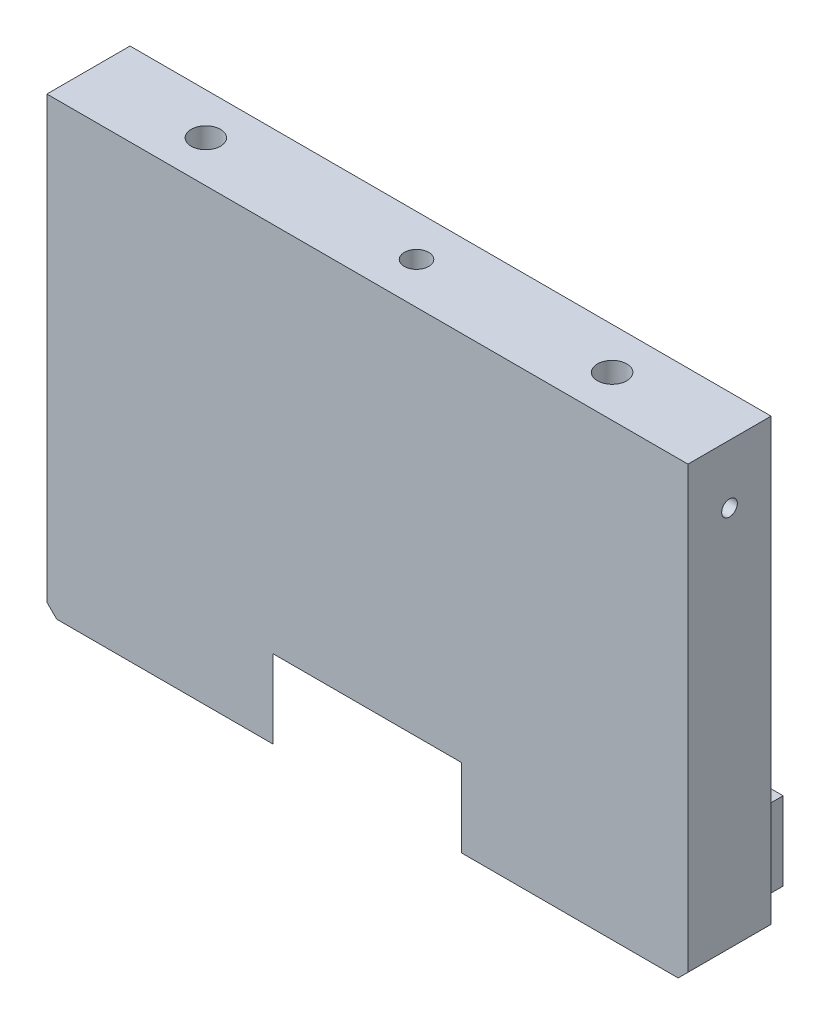
ISO-10303-21;
HEADER;
FILE_DESCRIPTION(('STEP AP214'),'2;1');
FILE_NAME('part.step','',(''),(''),'','','');
FILE_SCHEMA(('AUTOMOTIVE_DESIGN { 1 0 10303 214 1 1 1 1 }'));
ENDSEC;
DATA;
#1=APPLICATION_CONTEXT('core data for automotive mechanical design processes');
#2=APPLICATION_PROTOCOL_DEFINITION('international standard','automotive_design',2000,#1);
#3=PRODUCT_CONTEXT('',#1,'mechanical');
#4=PRODUCT('Part','Part','',(#3));
#5=PRODUCT_RELATED_PRODUCT_CATEGORY('part','',(#4));
#6=PRODUCT_DEFINITION_FORMATION('','',#4);
#7=PRODUCT_DEFINITION_CONTEXT('part definition',#1,'design');
#8=PRODUCT_DEFINITION('design','',#6,#7);
#9=PRODUCT_DEFINITION_SHAPE('','',#8);
#10=(LENGTH_UNIT() NAMED_UNIT(*) SI_UNIT(.MILLI.,.METRE.));
#11=(NAMED_UNIT(*) PLANE_ANGLE_UNIT() SI_UNIT($,.RADIAN.));
#12=(NAMED_UNIT(*) SI_UNIT($,.STERADIAN.) SOLID_ANGLE_UNIT());
#13=UNCERTAINTY_MEASURE_WITH_UNIT(LENGTH_MEASURE(1.E-05),#10,'distance_accuracy_value','');
#14=(GEOMETRIC_REPRESENTATION_CONTEXT(3) GLOBAL_UNCERTAINTY_ASSIGNED_CONTEXT((#13)) GLOBAL_UNIT_ASSIGNED_CONTEXT((#10,
#11,#12)) REPRESENTATION_CONTEXT('',''));
#15=CARTESIAN_POINT('',(0.,0.,0.));
#16=DIRECTION('',(0.,0.,1.));
#17=DIRECTION('',(1.,0.,0.));
#18=AXIS2_PLACEMENT_3D('',#15,#16,#17);
#19=CARTESIAN_POINT('',(-32.77,-23.,3.5));
#20=DIRECTION('',(0.,1.,0.));
#21=DIRECTION('',(0.,0.,1.));
#22=AXIS2_PLACEMENT_3D('',#19,#20,#21);
#23=PLANE('',#22);
#24=CARTESIAN_POINT('',(-28.0334,-23.,-0.500000000000021));
#25=DIRECTION('',(0.,-1.,0.));
#26=DIRECTION('',(0.,0.,-1.));
#27=AXIS2_PLACEMENT_3D('',#24,#25,#26);
#28=CIRCLE('',#27,0.799999999999992);
#29=CARTESIAN_POINT('',(-28.0334,-23.,-1.30000000000001));
#30=VERTEX_POINT('',#29);
#31=EDGE_CURVE('E171',#30,#30,#28,.T.);
#32=ORIENTED_EDGE('',*,*,#31,.F.);
#33=EDGE_LOOP('',(#32));
#34=FACE_BOUND('',#33,.T.);
#35=DIRECTION('',(1.,0.,0.));
#36=VECTOR('',#35,1.);
#37=CARTESIAN_POINT('',(-32.77,-23.,3.5));
#38=LINE('',#37,#36);
#39=CARTESIAN_POINT('',(-31.77,-23.,3.5));
#40=VERTEX_POINT('',#39);
#41=CARTESIAN_POINT('',(-9.62964227871578,-23.,3.5));
#42=VERTEX_POINT('',#41);
#43=EDGE_CURVE('E274',#40,#42,#38,.T.);
#44=ORIENTED_EDGE('',*,*,#43,.F.);
#45=DIRECTION('',(0.,0.,-1.));
#46=VECTOR('',#45,1.);
#47=CARTESIAN_POINT('',(-31.77,-23.,3.5));
#48=LINE('',#47,#46);
#49=CARTESIAN_POINT('',(-31.77,-23.,-5.));
#50=VERTEX_POINT('',#49);
#51=EDGE_CURVE('E287',#40,#50,#48,.T.);
#52=ORIENTED_EDGE('',*,*,#51,.T.);
#53=DIRECTION('',(-1.,0.,0.));
#54=VECTOR('',#53,1.);
#55=CARTESIAN_POINT('',(-29.,-23.,-5.));
#56=LINE('',#55,#54);
#57=CARTESIAN_POINT('',(-29.,-23.,-5.));
#58=VERTEX_POINT('',#57);
#59=EDGE_CURVE('E217',#58,#50,#56,.T.);
#60=ORIENTED_EDGE('',*,*,#59,.F.);
#61=DIRECTION('',(0.,0.,1.));
#62=VECTOR('',#61,1.);
#63=CARTESIAN_POINT('',(-29.,-23.,-10.));
#64=LINE('',#63,#62);
#65=CARTESIAN_POINT('',(-29.,-23.,-10.));
#66=VERTEX_POINT('',#65);
#67=EDGE_CURVE('E260',#66,#58,#64,.T.);
#68=ORIENTED_EDGE('',*,*,#67,.F.);
#69=DIRECTION('',(-1.,0.,0.));
#70=VECTOR('',#69,1.);
#71=CARTESIAN_POINT('',(29.,-23.,-10.));
#72=LINE('',#71,#70);
#73=CARTESIAN_POINT('',(-26.031085863364,-23.,-10.));
#74=VERTEX_POINT('',#73);
#75=EDGE_CURVE('E244',#74,#66,#72,.T.);
#76=ORIENTED_EDGE('',*,*,#75,.F.);
#77=CARTESIAN_POINT('',(0.,-23.,-24.9124970670296));
#78=DIRECTION('',(0.,-1.,0.));
#79=DIRECTION('',(0.,0.,-1.));
#80=AXIS2_PLACEMENT_3D('',#77,#78,#79);
#81=CIRCLE('',#80,29.9999999999999);
#82=EDGE_CURVE('E222',#42,#74,#81,.T.);
#83=ORIENTED_EDGE('',*,*,#82,.F.);
#84=EDGE_LOOP('',(#44,#52,#60,#68,#76,#83));
#85=FACE_BOUND('',#84,.T.);
#86=ADVANCED_FACE('F40',(#34,#85),#23,.F.);
#87=CARTESIAN_POINT('',(29.,-15.,-10.));
#88=DIRECTION('',(0.,-1.,0.));
#89=DIRECTION('',(0.,0.,-1.));
#90=AXIS2_PLACEMENT_3D('',#87,#88,#89);
#91=PLANE('',#90);
#92=DIRECTION('',(0.,0.,1.));
#93=VECTOR('',#92,1.);
#94=CARTESIAN_POINT('',(-29.,-15.,-10.));
#95=LINE('',#94,#93);
#96=CARTESIAN_POINT('',(-29.,-15.,-10.));
#97=VERTEX_POINT('',#96);
#98=CARTESIAN_POINT('',(-29.,-15.,-5.));
#99=VERTEX_POINT('',#98);
#100=EDGE_CURVE('E257',#97,#99,#95,.T.);
#101=ORIENTED_EDGE('',*,*,#100,.T.);
#102=DIRECTION('',(-1.,0.,0.));
#103=VECTOR('',#102,1.);
#104=CARTESIAN_POINT('',(29.,-15.,-5.));
#105=LINE('',#104,#103);
#106=CARTESIAN_POINT('',(-22.4386376715596,-15.,-5.));
#107=VERTEX_POINT('',#106);
#108=EDGE_CURVE('E210',#107,#99,#105,.T.);
#109=ORIENTED_EDGE('',*,*,#108,.F.);
#110=CARTESIAN_POINT('',(0.,-15.,-24.9124970670296));
#111=DIRECTION('',(0.,-1.,0.));
#112=DIRECTION('',(0.,0.,-1.));
#113=AXIS2_PLACEMENT_3D('',#110,#111,#112);
#114=CIRCLE('',#113,29.9999999999999);
#115=CARTESIAN_POINT('',(-26.031085863364,-15.,-10.));
#116=VERTEX_POINT('',#115);
#117=EDGE_CURVE('E223',#107,#116,#114,.T.);
#118=ORIENTED_EDGE('',*,*,#117,.T.);
#119=DIRECTION('',(1.,0.,0.));
#120=VECTOR('',#119,1.);
#121=CARTESIAN_POINT('',(29.,-15.,-10.));
#122=LINE('',#121,#120);
#123=EDGE_CURVE('E251',#97,#116,#122,.T.);
#124=ORIENTED_EDGE('',*,*,#123,.F.);
#125=EDGE_LOOP('',(#101,#109,#118,#124));
#126=FACE_BOUND('',#125,.T.);
#127=ADVANCED_FACE('F335',(#126),#91,.F.);
#128=CARTESIAN_POINT('',(0.,0.,-10.));
#129=DIRECTION('',(0.,0.,1.));
#130=DIRECTION('',(1.,0.,0.));
#131=AXIS2_PLACEMENT_3D('',#128,#129,#130);
#132=PLANE('',#131);
#133=ORIENTED_EDGE('',*,*,#123,.T.);
#134=DIRECTION('',(0.,-1.,0.));
#135=VECTOR('',#134,1.);
#136=CARTESIAN_POINT('',(-26.031085863364,-15.,-10.));
#137=LINE('',#136,#135);
#138=EDGE_CURVE('E284',#116,#74,#137,.T.);
#139=ORIENTED_EDGE('',*,*,#138,.T.);
#140=ORIENTED_EDGE('',*,*,#75,.T.);
#141=DIRECTION('',(0.,1.,0.));
#142=VECTOR('',#141,1.);
#143=CARTESIAN_POINT('',(-29.,-23.,-10.));
#144=LINE('',#143,#142);
#145=EDGE_CURVE('E248',#66,#97,#144,.T.);
#146=ORIENTED_EDGE('',*,*,#145,.T.);
#147=EDGE_LOOP('',(#133,#139,#140,#146));
#148=FACE_BOUND('',#147,.T.);
#149=ADVANCED_FACE('F339',(#148),#132,.F.);
#150=CARTESIAN_POINT('',(32.77,23.,3.5));
#151=DIRECTION('',(-1.,0.,0.));
#152=DIRECTION('',(0.,-1.,0.));
#153=AXIS2_PLACEMENT_3D('',#150,#151,#152);
#154=PLANE('',#153);
#155=CARTESIAN_POINT('',(32.77,17.,-0.750000000000001));
#156=DIRECTION('',(1.,0.,0.));
#157=DIRECTION('',(0.,0.,-1.));
#158=AXIS2_PLACEMENT_3D('',#155,#156,#157);
#159=CIRCLE('',#158,0.799999999999988);
#160=CARTESIAN_POINT('',(32.77,17.,-1.54999999999999));
#161=VERTEX_POINT('',#160);
#162=EDGE_CURVE('E172',#161,#161,#159,.T.);
#163=ORIENTED_EDGE('',*,*,#162,.F.);
#164=EDGE_LOOP('',(#163));
#165=FACE_BOUND('',#164,.T.);
#166=DIRECTION('',(0.,1.,0.));
#167=VECTOR('',#166,1.);
#168=CARTESIAN_POINT('',(32.77,23.,3.5));
#169=LINE('',#168,#167);
#170=CARTESIAN_POINT('',(32.77,-22.,3.5));
#171=VERTEX_POINT('',#170);
#172=CARTESIAN_POINT('',(32.77,23.,3.5));
#173=VERTEX_POINT('',#172);
#174=EDGE_CURVE('E266',#171,#173,#169,.T.);
#175=ORIENTED_EDGE('',*,*,#174,.F.);
#176=DIRECTION('',(0.,0.,-1.));
#177=VECTOR('',#176,1.);
#178=CARTESIAN_POINT('',(32.77,-22.,3.5));
#179=LINE('',#178,#177);
#180=CARTESIAN_POINT('',(32.77,-22.,-5.));
#181=VERTEX_POINT('',#180);
#182=EDGE_CURVE('E49',#171,#181,#179,.T.);
#183=ORIENTED_EDGE('',*,*,#182,.T.);
#184=DIRECTION('',(0.,-1.,0.));
#185=VECTOR('',#184,1.);
#186=CARTESIAN_POINT('',(32.77,23.,-5.));
#187=LINE('',#186,#185);
#188=CARTESIAN_POINT('',(32.77,23.,-5.));
#189=VERTEX_POINT('',#188);
#190=EDGE_CURVE('E203',#189,#181,#187,.T.);
#191=ORIENTED_EDGE('',*,*,#190,.F.);
#192=DIRECTION('',(0.,0.,-1.));
#193=VECTOR('',#192,1.);
#194=CARTESIAN_POINT('',(32.77,23.,3.5));
#195=LINE('',#194,#193);
#196=EDGE_CURVE('E279',#173,#189,#195,.T.);
#197=ORIENTED_EDGE('',*,*,#196,.F.);
#198=EDGE_LOOP('',(#175,#183,#191,#197));
#199=FACE_BOUND('',#198,.T.);
#200=ADVANCED_FACE('F302',(#165,#199),#154,.F.);
#201=CARTESIAN_POINT('',(-32.77,23.,3.5));
#202=DIRECTION('',(0.,-1.,0.));
#203=DIRECTION('',(0.,0.,-1.));
#204=AXIS2_PLACEMENT_3D('',#201,#202,#203);
#205=PLANE('',#204);
#206=CARTESIAN_POINT('',(0.77,23.,-0.75));
#207=DIRECTION('',(0.,1.,0.));
#208=DIRECTION('',(0.,0.,1.));
#209=AXIS2_PLACEMENT_3D('',#206,#207,#208);
#210=CIRCLE('',#209,1.25);
#211=CARTESIAN_POINT('',(0.77,23.,0.499999999999999));
#212=VERTEX_POINT('',#211);
#213=EDGE_CURVE('E182',#212,#212,#210,.T.);
#214=ORIENTED_EDGE('',*,*,#213,.F.);
#215=EDGE_LOOP('',(#214));
#216=FACE_BOUND('',#215,.T.);
#217=CARTESIAN_POINT('',(-20.77,23.,-0.75));
#218=DIRECTION('',(0.,1.,0.));
#219=DIRECTION('',(0.,0.,1.));
#220=AXIS2_PLACEMENT_3D('',#217,#218,#219);
#221=CIRCLE('',#220,1.49999999999999);
#222=CARTESIAN_POINT('',(-20.77,23.,0.749999999999987));
#223=VERTEX_POINT('',#222);
#224=EDGE_CURVE('E188',#223,#223,#221,.T.);
#225=ORIENTED_EDGE('',*,*,#224,.F.);
#226=EDGE_LOOP('',(#225));
#227=FACE_BOUND('',#226,.T.);
#228=CARTESIAN_POINT('',(20.77,23.,-0.75));
#229=DIRECTION('',(0.,1.,0.));
#230=DIRECTION('',(0.,0.,1.));
#231=AXIS2_PLACEMENT_3D('',#228,#229,#230);
#232=CIRCLE('',#231,1.49999999999999);
#233=CARTESIAN_POINT('',(20.77,23.,0.749999999999991));
#234=VERTEX_POINT('',#233);
#235=EDGE_CURVE('E194',#234,#234,#232,.T.);
#236=ORIENTED_EDGE('',*,*,#235,.F.);
#237=EDGE_LOOP('',(#236));
#238=FACE_BOUND('',#237,.T.);
#239=ORIENTED_EDGE('',*,*,#196,.T.);
#240=DIRECTION('',(1.,0.,0.));
#241=VECTOR('',#240,1.);
#242=CARTESIAN_POINT('',(-32.77,23.,-5.));
#243=LINE('',#242,#241);
#244=CARTESIAN_POINT('',(-32.77,23.,-5.));
#245=VERTEX_POINT('',#244);
#246=EDGE_CURVE('E200',#245,#189,#243,.T.);
#247=ORIENTED_EDGE('',*,*,#246,.F.);
#248=DIRECTION('',(0.,0.,-1.));
#249=VECTOR('',#248,1.);
#250=CARTESIAN_POINT('',(-32.77,23.,3.5));
#251=LINE('',#250,#249);
#252=CARTESIAN_POINT('',(-32.77,23.,3.5));
#253=VERTEX_POINT('',#252);
#254=EDGE_CURVE('E276',#253,#245,#251,.T.);
#255=ORIENTED_EDGE('',*,*,#254,.F.);
#256=DIRECTION('',(-1.,0.,0.));
#257=VECTOR('',#256,1.);
#258=CARTESIAN_POINT('',(-32.77,23.,3.5));
#259=LINE('',#258,#257);
#260=EDGE_CURVE('E268',#173,#253,#259,.T.);
#261=ORIENTED_EDGE('',*,*,#260,.F.);
#262=EDGE_LOOP('',(#239,#247,#255,#261));
#263=FACE_BOUND('',#262,.T.);
#264=ADVANCED_FACE('F311',(#216,#227,#238,#263),#205,.F.);
#265=CARTESIAN_POINT('',(-32.77,23.,3.5));
#266=DIRECTION('',(1.,0.,0.));
#267=DIRECTION('',(0.,1.,0.));
#268=AXIS2_PLACEMENT_3D('',#265,#266,#267);
#269=PLANE('',#268);
#270=DIRECTION('',(0.,1.,0.));
#271=VECTOR('',#270,1.);
#272=CARTESIAN_POINT('',(-32.77,-23.,-5.));
#273=LINE('',#272,#271);
#274=CARTESIAN_POINT('',(-32.77,-22.,-5.));
#275=VERTEX_POINT('',#274);
#276=EDGE_CURVE('E220',#275,#245,#273,.T.);
#277=ORIENTED_EDGE('',*,*,#276,.F.);
#278=DIRECTION('',(0.,0.,1.));
#279=VECTOR('',#278,1.);
#280=CARTESIAN_POINT('',(-32.77,-22.,3.5));
#281=LINE('',#280,#279);
#282=CARTESIAN_POINT('',(-32.77,-22.,3.5));
#283=VERTEX_POINT('',#282);
#284=EDGE_CURVE('E294',#275,#283,#281,.T.);
#285=ORIENTED_EDGE('',*,*,#284,.T.);
#286=DIRECTION('',(0.,-1.,0.));
#287=VECTOR('',#286,1.);
#288=CARTESIAN_POINT('',(-32.77,23.,3.5));
#289=LINE('',#288,#287);
#290=EDGE_CURVE('E270',#253,#283,#289,.T.);
#291=ORIENTED_EDGE('',*,*,#290,.F.);
#292=ORIENTED_EDGE('',*,*,#254,.T.);
#293=EDGE_LOOP('',(#277,#285,#291,#292));
#294=FACE_BOUND('',#293,.T.);
#295=ADVANCED_FACE('F384',(#294),#269,.F.);
#296=DIRECTION('',(-1.,0.,0.));
#297=VECTOR('',#296,1.);
#298=CARTESIAN_POINT('',(32.77,-23.,-5.));
#299=LINE('',#298,#297);
#300=CARTESIAN_POINT('',(31.77,-23.,-5.));
#301=VERTEX_POINT('',#300);
#302=CARTESIAN_POINT('',(29.,-23.,-5.));
#303=VERTEX_POINT('',#302);
#304=EDGE_CURVE('E206',#301,#303,#299,.T.);
#305=ORIENTED_EDGE('',*,*,#304,.F.);
#306=DIRECTION('',(0.,0.,1.));
#307=VECTOR('',#306,1.);
#308=CARTESIAN_POINT('',(31.77,-23.,3.5));
#309=LINE('',#308,#307);
#310=CARTESIAN_POINT('',(31.77,-23.,3.5));
#311=VERTEX_POINT('',#310);
#312=EDGE_CURVE('E11',#301,#311,#309,.T.);
#313=ORIENTED_EDGE('',*,*,#312,.T.);
#314=CARTESIAN_POINT('',(9.62964227871582,-23.,3.5));
#315=VERTEX_POINT('',#314);
#316=EDGE_CURVE('E273',#315,#311,#38,.T.);
#317=ORIENTED_EDGE('',*,*,#316,.F.);
#318=CARTESIAN_POINT('',(0.,-23.,-24.9124970670296));
#319=DIRECTION('',(0.,-1.,0.));
#320=DIRECTION('',(0.,0.,-1.));
#321=AXIS2_PLACEMENT_3D('',#318,#319,#320);
#322=CIRCLE('',#321,29.9999999999999);
#323=CARTESIAN_POINT('',(26.031085863364,-23.,-10.));
#324=VERTEX_POINT('',#323);
#325=EDGE_CURVE('E226',#324,#315,#322,.T.);
#326=ORIENTED_EDGE('',*,*,#325,.F.);
#327=CARTESIAN_POINT('',(29.,-23.,-10.));
#328=VERTEX_POINT('',#327);
#329=EDGE_CURVE('E245',#328,#324,#72,.T.);
#330=ORIENTED_EDGE('',*,*,#329,.F.);
#331=DIRECTION('',(0.,0.,1.));
#332=VECTOR('',#331,1.);
#333=CARTESIAN_POINT('',(29.,-23.,-10.));
#334=LINE('',#333,#332);
#335=EDGE_CURVE('E263',#328,#303,#334,.T.);
#336=ORIENTED_EDGE('',*,*,#335,.T.);
#337=EDGE_LOOP('',(#305,#313,#317,#326,#330,#336));
#338=FACE_BOUND('',#337,.T.);
#339=ADVANCED_FACE('F353',(#338),#23,.F.);
#340=CARTESIAN_POINT('',(0.,0.,3.5));
#341=DIRECTION('',(0.,0.,1.));
#342=DIRECTION('',(1.,0.,0.));
#343=AXIS2_PLACEMENT_3D('',#340,#341,#342);
#344=PLANE('',#343);
#345=ORIENTED_EDGE('',*,*,#290,.T.);
#346=DIRECTION('',(-0.707106781186548,0.707106781186548,0.));
#347=VECTOR('',#346,1.);
#348=CARTESIAN_POINT('',(-27.385,-27.385,3.5));
#349=LINE('',#348,#347);
#350=EDGE_CURVE('E297',#283,#40,#349,.F.);
#351=ORIENTED_EDGE('',*,*,#350,.T.);
#352=ORIENTED_EDGE('',*,*,#43,.T.);
#353=DIRECTION('',(0.,-1.,0.));
#354=VECTOR('',#353,1.);
#355=CARTESIAN_POINT('',(-9.62964227871578,-15.,3.5));
#356=LINE('',#355,#354);
#357=CARTESIAN_POINT('',(-9.62964227871578,-15.,3.5));
#358=VERTEX_POINT('',#357);
#359=EDGE_CURVE('E238',#358,#42,#356,.T.);
#360=ORIENTED_EDGE('',*,*,#359,.F.);
#361=DIRECTION('',(1.,0.,0.));
#362=VECTOR('',#361,1.);
#363=CARTESIAN_POINT('',(0.,-15.,3.5));
#364=LINE('',#363,#362);
#365=CARTESIAN_POINT('',(9.62964227871582,-15.,3.5));
#366=VERTEX_POINT('',#365);
#367=EDGE_CURVE('E233',#358,#366,#364,.T.);
#368=ORIENTED_EDGE('',*,*,#367,.T.);
#369=DIRECTION('',(0.,-1.,0.));
#370=VECTOR('',#369,1.);
#371=CARTESIAN_POINT('',(9.62964227871582,-15.,3.5));
#372=LINE('',#371,#370);
#373=EDGE_CURVE('E236',#315,#366,#372,.F.);
#374=ORIENTED_EDGE('',*,*,#373,.F.);
#375=ORIENTED_EDGE('',*,*,#316,.T.);
#376=DIRECTION('',(-0.707106781186552,-0.707106781186543,0.));
#377=VECTOR('',#376,1.);
#378=CARTESIAN_POINT('',(27.3849999999998,-27.3850000000002,3.5));
#379=LINE('',#378,#377);
#380=EDGE_CURVE('E56',#311,#171,#379,.F.);
#381=ORIENTED_EDGE('',*,*,#380,.T.);
#382=ORIENTED_EDGE('',*,*,#174,.T.);
#383=ORIENTED_EDGE('',*,*,#260,.T.);
#384=EDGE_LOOP('',(#345,#351,#352,#360,#368,#374,#375,#381,#382,#383));
#385=FACE_BOUND('',#384,.T.);
#386=ADVANCED_FACE('F314',(#385),#344,.T.);
#387=CARTESIAN_POINT('',(29.,-23.,-10.));
#388=DIRECTION('',(-1.,0.,0.));
#389=DIRECTION('',(0.,0.,1.));
#390=AXIS2_PLACEMENT_3D('',#387,#388,#389);
#391=PLANE('',#390);
#392=DIRECTION('',(0.,0.,1.));
#393=VECTOR('',#392,1.);
#394=CARTESIAN_POINT('',(29.,-15.,-10.));
#395=LINE('',#394,#393);
#396=CARTESIAN_POINT('',(29.,-15.,-10.));
#397=VERTEX_POINT('',#396);
#398=CARTESIAN_POINT('',(29.,-15.,-5.));
#399=VERTEX_POINT('',#398);
#400=EDGE_CURVE('E254',#397,#399,#395,.T.);
#401=ORIENTED_EDGE('',*,*,#400,.T.);
#402=DIRECTION('',(0.,1.,0.));
#403=VECTOR('',#402,1.);
#404=CARTESIAN_POINT('',(29.,-23.,-5.));
#405=LINE('',#404,#403);
#406=EDGE_CURVE('E208',#303,#399,#405,.T.);
#407=ORIENTED_EDGE('',*,*,#406,.F.);
#408=ORIENTED_EDGE('',*,*,#335,.F.);
#409=DIRECTION('',(0.,-1.,0.));
#410=VECTOR('',#409,1.);
#411=CARTESIAN_POINT('',(29.,-23.,-10.));
#412=LINE('',#411,#410);
#413=EDGE_CURVE('E241',#397,#328,#412,.T.);
#414=ORIENTED_EDGE('',*,*,#413,.F.);
#415=EDGE_LOOP('',(#401,#407,#408,#414));
#416=FACE_BOUND('',#415,.T.);
#417=ADVANCED_FACE('F362',(#416),#391,.F.);
#418=CARTESIAN_POINT('',(-29.,-23.,-10.));
#419=DIRECTION('',(1.,0.,0.));
#420=DIRECTION('',(0.,1.,0.));
#421=AXIS2_PLACEMENT_3D('',#418,#419,#420);
#422=PLANE('',#421);
#423=ORIENTED_EDGE('',*,*,#67,.T.);
#424=DIRECTION('',(0.,-1.,0.));
#425=VECTOR('',#424,1.);
#426=CARTESIAN_POINT('',(-29.,-15.,-5.));
#427=LINE('',#426,#425);
#428=EDGE_CURVE('E214',#99,#58,#427,.T.);
#429=ORIENTED_EDGE('',*,*,#428,.F.);
#430=ORIENTED_EDGE('',*,*,#100,.F.);
#431=ORIENTED_EDGE('',*,*,#145,.F.);
#432=EDGE_LOOP('',(#423,#429,#430,#431));
#433=FACE_BOUND('',#432,.T.);
#434=ADVANCED_FACE('F331',(#433),#422,.F.);
#435=CARTESIAN_POINT('',(0.,-15.,-24.9124970670296));
#436=DIRECTION('',(0.,-1.,0.));
#437=DIRECTION('',(0.,0.,-1.));
#438=AXIS2_PLACEMENT_3D('',#435,#436,#437);
#439=CIRCLE('',#438,29.9999999999999);
#440=CARTESIAN_POINT('',(26.031085863364,-15.,-10.));
#441=VERTEX_POINT('',#440);
#442=CARTESIAN_POINT('',(22.4386376715596,-15.,-5.));
#443=VERTEX_POINT('',#442);
#444=EDGE_CURVE('E230',#441,#443,#439,.T.);
#445=ORIENTED_EDGE('',*,*,#444,.T.);
#446=EDGE_CURVE('E211',#399,#443,#105,.T.);
#447=ORIENTED_EDGE('',*,*,#446,.F.);
#448=ORIENTED_EDGE('',*,*,#400,.F.);
#449=EDGE_CURVE('E250',#441,#397,#122,.T.);
#450=ORIENTED_EDGE('',*,*,#449,.F.);
#451=EDGE_LOOP('',(#445,#447,#448,#450));
#452=FACE_BOUND('',#451,.T.);
#453=ADVANCED_FACE('F379',(#452),#91,.F.);
#454=ORIENTED_EDGE('',*,*,#329,.T.);
#455=DIRECTION('',(0.,-1.,0.));
#456=VECTOR('',#455,1.);
#457=CARTESIAN_POINT('',(26.031085863364,-15.,-10.));
#458=LINE('',#457,#456);
#459=EDGE_CURVE('E281',#324,#441,#458,.F.);
#460=ORIENTED_EDGE('',*,*,#459,.T.);
#461=ORIENTED_EDGE('',*,*,#449,.T.);
#462=ORIENTED_EDGE('',*,*,#413,.T.);
#463=EDGE_LOOP('',(#454,#460,#461,#462));
#464=FACE_BOUND('',#463,.T.);
#465=ADVANCED_FACE('F355',(#464),#132,.F.);
#466=CARTESIAN_POINT('',(0.,-15.,-24.9124970670296));
#467=DIRECTION('',(0.,-1.,0.));
#468=DIRECTION('',(0.,0.,-1.));
#469=AXIS2_PLACEMENT_3D('',#466,#467,#468);
#470=CYLINDRICAL_SURFACE('',#469,29.9999999999999);
#471=ORIENTED_EDGE('',*,*,#359,.T.);
#472=ORIENTED_EDGE('',*,*,#82,.T.);
#473=ORIENTED_EDGE('',*,*,#138,.F.);
#474=ORIENTED_EDGE('',*,*,#117,.F.);
#475=EDGE_CURVE('E225',#358,#107,#114,.T.);
#476=ORIENTED_EDGE('',*,*,#475,.F.);
#477=EDGE_LOOP('',(#471,#472,#473,#474,#476));
#478=FACE_BOUND('',#477,.T.);
#479=ADVANCED_FACE('F342',(#478),#470,.F.);
#480=CARTESIAN_POINT('',(0.,-15.,-24.9124970670296));
#481=DIRECTION('',(0.,-1.,0.));
#482=DIRECTION('',(0.,0.,-1.));
#483=AXIS2_PLACEMENT_3D('',#480,#481,#482);
#484=CYLINDRICAL_SURFACE('',#483,29.9999999999999);
#485=ORIENTED_EDGE('',*,*,#373,.T.);
#486=EDGE_CURVE('E227',#443,#366,#439,.T.);
#487=ORIENTED_EDGE('',*,*,#486,.F.);
#488=ORIENTED_EDGE('',*,*,#444,.F.);
#489=ORIENTED_EDGE('',*,*,#459,.F.);
#490=ORIENTED_EDGE('',*,*,#325,.T.);
#491=EDGE_LOOP('',(#485,#487,#488,#489,#490));
#492=FACE_BOUND('',#491,.T.);
#493=ADVANCED_FACE('F350',(#492),#484,.F.);
#494=CARTESIAN_POINT('',(0.,-15.,-24.9124970670296));
#495=DIRECTION('',(0.,-1.,0.));
#496=DIRECTION('',(0.,0.,-1.));
#497=AXIS2_PLACEMENT_3D('',#494,#495,#496);
#498=PLANE('',#497);
#499=ORIENTED_EDGE('',*,*,#475,.T.);
#500=EDGE_CURVE('E215',#443,#107,#105,.T.);
#501=ORIENTED_EDGE('',*,*,#500,.F.);
#502=ORIENTED_EDGE('',*,*,#486,.T.);
#503=ORIENTED_EDGE('',*,*,#367,.F.);
#504=EDGE_LOOP('',(#499,#501,#502,#503));
#505=FACE_BOUND('',#504,.T.);
#506=ADVANCED_FACE('F347',(#505),#498,.T.);
#507=CARTESIAN_POINT('',(0.,0.,-5.));
#508=DIRECTION('',(0.,0.,-1.));
#509=DIRECTION('',(-1.,0.,0.));
#510=AXIS2_PLACEMENT_3D('',#507,#508,#509);
#511=PLANE('',#510);
#512=ORIENTED_EDGE('',*,*,#59,.T.);
#513=DIRECTION('',(0.707106781186548,-0.707106781186548,0.));
#514=VECTOR('',#513,1.);
#515=CARTESIAN_POINT('',(-27.385,-27.385,-5.));
#516=LINE('',#515,#514);
#517=EDGE_CURVE('E292',#50,#275,#516,.F.);
#518=ORIENTED_EDGE('',*,*,#517,.T.);
#519=ORIENTED_EDGE('',*,*,#276,.T.);
#520=ORIENTED_EDGE('',*,*,#246,.T.);
#521=ORIENTED_EDGE('',*,*,#190,.T.);
#522=DIRECTION('',(0.707106781186552,0.707106781186543,0.));
#523=VECTOR('',#522,1.);
#524=CARTESIAN_POINT('',(27.3849999999998,-27.3850000000002,-5.));
#525=LINE('',#524,#523);
#526=EDGE_CURVE('E290',#181,#301,#525,.F.);
#527=ORIENTED_EDGE('',*,*,#526,.T.);
#528=ORIENTED_EDGE('',*,*,#304,.T.);
#529=ORIENTED_EDGE('',*,*,#406,.T.);
#530=ORIENTED_EDGE('',*,*,#446,.T.);
#531=ORIENTED_EDGE('',*,*,#500,.T.);
#532=ORIENTED_EDGE('',*,*,#108,.T.);
#533=ORIENTED_EDGE('',*,*,#428,.T.);
#534=EDGE_LOOP('',(#512,#518,#519,#520,#521,#527,#528,#529,#530,#531,#532,#533));
#535=FACE_BOUND('',#534,.T.);
#536=ADVANCED_FACE('F306',(#535),#511,.T.);
#537=CARTESIAN_POINT('',(-31.77,-23.,3.5));
#538=DIRECTION('',(0.707106781186547,0.707106781186547,0.));
#539=DIRECTION('',(0.,0.,-1.));
#540=AXIS2_PLACEMENT_3D('',#537,#538,#539);
#541=PLANE('',#540);
#542=ORIENTED_EDGE('',*,*,#350,.F.);
#543=ORIENTED_EDGE('',*,*,#284,.F.);
#544=ORIENTED_EDGE('',*,*,#517,.F.);
#545=ORIENTED_EDGE('',*,*,#51,.F.);
#546=EDGE_LOOP('',(#542,#543,#544,#545));
#547=FACE_BOUND('',#546,.T.);
#548=ADVANCED_FACE('F321',(#547),#541,.F.);
#549=CARTESIAN_POINT('',(32.77,-22.,3.5));
#550=DIRECTION('',(-0.707106781186542,0.707106781186552,0.));
#551=DIRECTION('',(0.,0.,-1.));
#552=AXIS2_PLACEMENT_3D('',#549,#550,#551);
#553=PLANE('',#552);
#554=ORIENTED_EDGE('',*,*,#380,.F.);
#555=ORIENTED_EDGE('',*,*,#312,.F.);
#556=ORIENTED_EDGE('',*,*,#526,.F.);
#557=ORIENTED_EDGE('',*,*,#182,.F.);
#558=EDGE_LOOP('',(#554,#555,#556,#557));
#559=FACE_BOUND('',#558,.T.);
#560=ADVANCED_FACE('F43',(#559),#553,.F.);
#561=CARTESIAN_POINT('',(20.77,18.5,-0.75));
#562=DIRECTION('',(0.,1.,0.));
#563=DIRECTION('',(0.,0.,1.));
#564=AXIS2_PLACEMENT_3D('',#561,#562,#563);
#565=CONICAL_SURFACE('',#564,1.5,1.02974425867665);
#566=CARTESIAN_POINT('',(20.77,17.5987090714587,-0.75));
#567=VERTEX_POINT('',#566);
#568=VERTEX_LOOP('',#567);
#569=FACE_BOUND('',#568,.T.);
#570=CARTESIAN_POINT('',(20.77,18.5,-0.75));
#571=DIRECTION('',(0.,1.,0.));
#572=DIRECTION('',(0.,0.,1.));
#573=AXIS2_PLACEMENT_3D('',#570,#571,#572);
#574=CIRCLE('',#573,1.5);
#575=CARTESIAN_POINT('',(20.77,18.5,0.749999999999998));
#576=VERTEX_POINT('',#575);
#577=EDGE_CURVE('E197',#576,#576,#574,.T.);
#578=ORIENTED_EDGE('',*,*,#577,.T.);
#579=EDGE_LOOP('',(#578));
#580=FACE_BOUND('',#579,.T.);
#581=ADVANCED_FACE('F364',(#569,#580),#565,.F.);
#582=CARTESIAN_POINT('',(20.77,23.,-0.75));
#583=DIRECTION('',(0.,1.,0.));
#584=DIRECTION('',(0.,0.,1.));
#585=AXIS2_PLACEMENT_3D('',#582,#583,#584);
#586=CYLINDRICAL_SURFACE('',#585,1.49999999999999);
#587=ORIENTED_EDGE('',*,*,#577,.F.);
#588=EDGE_LOOP('',(#587));
#589=FACE_BOUND('',#588,.T.);
#590=ORIENTED_EDGE('',*,*,#235,.T.);
#591=EDGE_LOOP('',(#590));
#592=FACE_BOUND('',#591,.T.);
#593=ADVANCED_FACE('F369',(#589,#592),#586,.F.);
#594=CARTESIAN_POINT('',(-20.77,18.5,-0.75));
#595=DIRECTION('',(0.,1.,0.));
#596=DIRECTION('',(0.,0.,1.));
#597=AXIS2_PLACEMENT_3D('',#594,#595,#596);
#598=CONICAL_SURFACE('',#597,1.5,1.02974425867665);
#599=CARTESIAN_POINT('',(-20.77,17.5987090714587,-0.75));
#600=VERTEX_POINT('',#599);
#601=VERTEX_LOOP('',#600);
#602=FACE_BOUND('',#601,.T.);
#603=CARTESIAN_POINT('',(-20.77,18.5,-0.75));
#604=DIRECTION('',(0.,1.,0.));
#605=DIRECTION('',(0.,0.,1.));
#606=AXIS2_PLACEMENT_3D('',#603,#604,#605);
#607=CIRCLE('',#606,1.5);
#608=CARTESIAN_POINT('',(-20.77,18.5,0.749999999999998));
#609=VERTEX_POINT('',#608);
#610=EDGE_CURVE('E191',#609,#609,#607,.T.);
#611=ORIENTED_EDGE('',*,*,#610,.T.);
#612=EDGE_LOOP('',(#611));
#613=FACE_BOUND('',#612,.T.);
#614=ADVANCED_FACE('F431',(#602,#613),#598,.F.);
#615=CARTESIAN_POINT('',(-20.77,23.,-0.75));
#616=DIRECTION('',(0.,1.,0.));
#617=DIRECTION('',(0.,0.,1.));
#618=AXIS2_PLACEMENT_3D('',#615,#616,#617);
#619=CYLINDRICAL_SURFACE('',#618,1.49999999999999);
#620=ORIENTED_EDGE('',*,*,#610,.F.);
#621=EDGE_LOOP('',(#620));
#622=FACE_BOUND('',#621,.T.);
#623=ORIENTED_EDGE('',*,*,#224,.T.);
#624=EDGE_LOOP('',(#623));
#625=FACE_BOUND('',#624,.T.);
#626=ADVANCED_FACE('F427',(#622,#625),#619,.F.);
#627=CARTESIAN_POINT('',(0.77,15.5,-0.75));
#628=DIRECTION('',(0.,1.,0.));
#629=DIRECTION('',(0.,0.,1.));
#630=AXIS2_PLACEMENT_3D('',#627,#628,#629);
#631=CONICAL_SURFACE('',#630,1.25,1.02974425867665);
#632=CARTESIAN_POINT('',(0.769999999999998,14.7489242262156,-0.75));
#633=VERTEX_POINT('',#632);
#634=VERTEX_LOOP('',#633);
#635=FACE_BOUND('',#634,.T.);
#636=CARTESIAN_POINT('',(0.77,15.5,-0.75));
#637=DIRECTION('',(0.,1.,0.));
#638=DIRECTION('',(0.,0.,1.));
#639=AXIS2_PLACEMENT_3D('',#636,#637,#638);
#640=CIRCLE('',#639,1.25);
#641=CARTESIAN_POINT('',(0.77,15.5,0.499999999999998));
#642=VERTEX_POINT('',#641);
#643=EDGE_CURVE('E185',#642,#642,#640,.T.);
#644=ORIENTED_EDGE('',*,*,#643,.T.);
#645=EDGE_LOOP('',(#644));
#646=FACE_BOUND('',#645,.T.);
#647=ADVANCED_FACE('F423',(#635,#646),#631,.F.);
#648=CARTESIAN_POINT('',(0.77,23.,-0.75));
#649=DIRECTION('',(0.,1.,0.));
#650=DIRECTION('',(0.,0.,1.));
#651=AXIS2_PLACEMENT_3D('',#648,#649,#650);
#652=CYLINDRICAL_SURFACE('',#651,1.25);
#653=ORIENTED_EDGE('',*,*,#643,.F.);
#654=EDGE_LOOP('',(#653));
#655=FACE_BOUND('',#654,.T.);
#656=ORIENTED_EDGE('',*,*,#213,.T.);
#657=EDGE_LOOP('',(#656));
#658=FACE_BOUND('',#657,.T.);
#659=ADVANCED_FACE('F419',(#655,#658),#652,.F.);
#660=CARTESIAN_POINT('',(-28.0334,-17.8,-0.500000000000021));
#661=DIRECTION('',(0.,-1.,0.));
#662=DIRECTION('',(0.,0.,-1.));
#663=AXIS2_PLACEMENT_3D('',#660,#661,#662);
#664=CONICAL_SURFACE('',#663,0.799999999999999,1.02974425867665);
#665=CARTESIAN_POINT('',(-28.0334,-17.3193115047779,-0.500000000000021));
#666=VERTEX_POINT('',#665);
#667=VERTEX_LOOP('',#666);
#668=FACE_BOUND('',#667,.T.);
#669=CARTESIAN_POINT('',(-28.0334,-17.8,-0.500000000000021));
#670=DIRECTION('',(0.,-1.,0.));
#671=DIRECTION('',(0.,0.,-1.));
#672=AXIS2_PLACEMENT_3D('',#669,#670,#671);
#673=CIRCLE('',#672,0.799999999999999);
#674=CARTESIAN_POINT('',(-28.0334,-17.8,-1.30000000000002));
#675=VERTEX_POINT('',#674);
#676=EDGE_CURVE('E175',#675,#675,#673,.T.);
#677=ORIENTED_EDGE('',*,*,#676,.T.);
#678=EDGE_LOOP('',(#677));
#679=FACE_BOUND('',#678,.T.);
#680=ADVANCED_FACE('F415',(#668,#679),#664,.F.);
#681=CARTESIAN_POINT('',(-28.0334,-23.,-0.500000000000021));
#682=DIRECTION('',(0.,-1.,0.));
#683=DIRECTION('',(0.,0.,-1.));
#684=AXIS2_PLACEMENT_3D('',#681,#682,#683);
#685=CYLINDRICAL_SURFACE('',#684,0.799999999999995);
#686=ORIENTED_EDGE('',*,*,#676,.F.);
#687=EDGE_LOOP('',(#686));
#688=FACE_BOUND('',#687,.T.);
#689=ORIENTED_EDGE('',*,*,#31,.T.);
#690=EDGE_LOOP('',(#689));
#691=FACE_BOUND('',#690,.T.);
#692=ADVANCED_FACE('F165',(#688,#691),#685,.F.);
#693=CARTESIAN_POINT('',(27.57,17.,-0.750000000000001));
#694=DIRECTION('',(1.,0.,0.));
#695=DIRECTION('',(0.,0.,-1.));
#696=AXIS2_PLACEMENT_3D('',#693,#694,#695);
#697=CONICAL_SURFACE('',#696,0.799999999999988,1.02974425867664);
#698=CARTESIAN_POINT('',(27.089311504778,17.,-0.750000000000001));
#699=VERTEX_POINT('',#698);
#700=VERTEX_LOOP('',#699);
#701=FACE_BOUND('',#700,.T.);
#702=CARTESIAN_POINT('',(27.57,17.,-0.750000000000001));
#703=DIRECTION('',(1.,0.,0.));
#704=DIRECTION('',(0.,0.,-1.));
#705=AXIS2_PLACEMENT_3D('',#702,#703,#704);
#706=CIRCLE('',#705,0.799999999999988);
#707=CARTESIAN_POINT('',(27.57,17.,-1.54999999999999));
#708=VERTEX_POINT('',#707);
#709=EDGE_CURVE('E169',#708,#708,#706,.T.);
#710=ORIENTED_EDGE('',*,*,#709,.T.);
#711=EDGE_LOOP('',(#710));
#712=FACE_BOUND('',#711,.T.);
#713=ADVANCED_FACE('F161',(#701,#712),#697,.F.);
#714=CARTESIAN_POINT('',(32.77,17.,-0.750000000000001));
#715=DIRECTION('',(1.,0.,0.));
#716=DIRECTION('',(0.,0.,-1.));
#717=AXIS2_PLACEMENT_3D('',#714,#715,#716);
#718=CYLINDRICAL_SURFACE('',#717,0.799999999999988);
#719=ORIENTED_EDGE('',*,*,#709,.F.);
#720=EDGE_LOOP('',(#719));
#721=FACE_BOUND('',#720,.T.);
#722=ORIENTED_EDGE('',*,*,#162,.T.);
#723=EDGE_LOOP('',(#722));
#724=FACE_BOUND('',#723,.T.);
#725=ADVANCED_FACE('F164',(#721,#724),#718,.F.);
#726=CLOSED_SHELL('',(#86,#127,#149,#200,#264,#295,#339,#386,#417,#434,#453,#465,#479,#493,#506,
#536,#548,#560,#581,#593,#614,#626,#647,#659,#680,#692,#713,#725));
#727=MANIFOLD_SOLID_BREP('B2',#726);
#728=ADVANCED_BREP_SHAPE_REPRESENTATION('',(#18,#727),#14);
#729=SHAPE_DEFINITION_REPRESENTATION(#9,#728);
ENDSEC;
END-ISO-10303-21;
